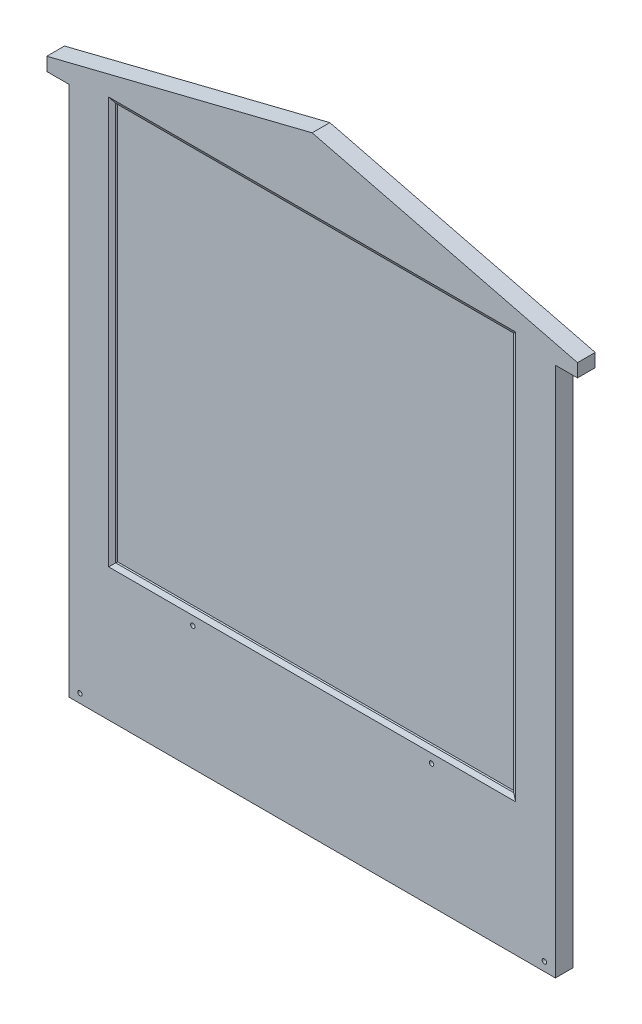
ISO-10303-21;
HEADER;
FILE_DESCRIPTION(('STEP AP214'),'2;1');
FILE_NAME('part.step','',(''),(''),'','','');
FILE_SCHEMA(('AUTOMOTIVE_DESIGN { 1 0 10303 214 1 1 1 1 }'));
ENDSEC;
DATA;
#1=APPLICATION_CONTEXT('core data for automotive mechanical design processes');
#2=APPLICATION_PROTOCOL_DEFINITION('international standard','automotive_design',2000,#1);
#3=PRODUCT_CONTEXT('',#1,'mechanical');
#4=PRODUCT('Part','Part','',(#3));
#5=PRODUCT_RELATED_PRODUCT_CATEGORY('part','',(#4));
#6=PRODUCT_DEFINITION_FORMATION('','',#4);
#7=PRODUCT_DEFINITION_CONTEXT('part definition',#1,'design');
#8=PRODUCT_DEFINITION('design','',#6,#7);
#9=PRODUCT_DEFINITION_SHAPE('','',#8);
#10=(LENGTH_UNIT() NAMED_UNIT(*) SI_UNIT(.MILLI.,.METRE.));
#11=(NAMED_UNIT(*) PLANE_ANGLE_UNIT() SI_UNIT($,.RADIAN.));
#12=(NAMED_UNIT(*) SI_UNIT($,.STERADIAN.) SOLID_ANGLE_UNIT());
#13=UNCERTAINTY_MEASURE_WITH_UNIT(LENGTH_MEASURE(1.E-05),#10,'distance_accuracy_value','');
#14=(GEOMETRIC_REPRESENTATION_CONTEXT(3) GLOBAL_UNCERTAINTY_ASSIGNED_CONTEXT((#13)) GLOBAL_UNIT_ASSIGNED_CONTEXT((#10,
#11,#12)) REPRESENTATION_CONTEXT('',''));
#15=CARTESIAN_POINT('',(0.,0.,0.));
#16=DIRECTION('',(0.,0.,1.));
#17=DIRECTION('',(1.,0.,0.));
#18=AXIS2_PLACEMENT_3D('',#15,#16,#17);
#19=CARTESIAN_POINT('',(-52.5,2.,2.00000000000002));
#20=DIRECTION('',(0.,0.,-1.));
#21=DIRECTION('',(-1.,0.,0.));
#22=AXIS2_PLACEMENT_3D('',#19,#20,#21);
#23=CYLINDRICAL_SURFACE('',#22,0.499999999999999);
#24=CARTESIAN_POINT('',(-52.5,2.,2.00000000000002));
#25=DIRECTION('',(0.,0.,-1.));
#26=DIRECTION('',(1.,0.,0.));
#27=AXIS2_PLACEMENT_3D('',#24,#25,#26);
#28=CIRCLE('',#27,0.499999999999999);
#29=CARTESIAN_POINT('',(-52.,2.,2.00000000000002));
#30=VERTEX_POINT('',#29);
#31=EDGE_CURVE('E180',#30,#30,#28,.T.);
#32=ORIENTED_EDGE('',*,*,#31,.F.);
#33=EDGE_LOOP('',(#32));
#34=FACE_BOUND('',#33,.T.);
#35=CARTESIAN_POINT('',(-52.5,2.,-0.999999999999988));
#36=DIRECTION('',(0.,0.,-1.));
#37=DIRECTION('',(-1.,0.,0.));
#38=AXIS2_PLACEMENT_3D('',#35,#36,#37);
#39=CIRCLE('',#38,0.499999999999999);
#40=CARTESIAN_POINT('',(-53.,2.,-0.999999999999988));
#41=VERTEX_POINT('',#40);
#42=EDGE_CURVE('E301',#41,#41,#39,.F.);
#43=ORIENTED_EDGE('',*,*,#42,.F.);
#44=EDGE_LOOP('',(#43));
#45=FACE_BOUND('',#44,.T.);
#46=ADVANCED_FACE('F38',(#34,#45),#23,.F.);
#47=CARTESIAN_POINT('',(-27.,28.,2.00000000000002));
#48=DIRECTION('',(0.,0.,-1.));
#49=DIRECTION('',(-1.,0.,0.));
#50=AXIS2_PLACEMENT_3D('',#47,#48,#49);
#51=CYLINDRICAL_SURFACE('',#50,0.499999999999999);
#52=CARTESIAN_POINT('',(-27.,28.,2.00000000000002));
#53=DIRECTION('',(0.,0.,-1.));
#54=DIRECTION('',(1.,0.,0.));
#55=AXIS2_PLACEMENT_3D('',#52,#53,#54);
#56=CIRCLE('',#55,0.499999999999999);
#57=CARTESIAN_POINT('',(-26.5,28.,2.00000000000002));
#58=VERTEX_POINT('',#57);
#59=EDGE_CURVE('E355',#58,#58,#56,.T.);
#60=ORIENTED_EDGE('',*,*,#59,.F.);
#61=EDGE_LOOP('',(#60));
#62=FACE_BOUND('',#61,.T.);
#63=CARTESIAN_POINT('',(-27.,28.,-0.999999999999991));
#64=DIRECTION('',(0.,0.,-1.));
#65=DIRECTION('',(-1.,0.,0.));
#66=AXIS2_PLACEMENT_3D('',#63,#64,#65);
#67=CIRCLE('',#66,0.499999999999999);
#68=CARTESIAN_POINT('',(-27.5,28.,-0.999999999999991));
#69=VERTEX_POINT('',#68);
#70=EDGE_CURVE('E297',#69,#69,#67,.F.);
#71=ORIENTED_EDGE('',*,*,#70,.F.);
#72=EDGE_LOOP('',(#71));
#73=FACE_BOUND('',#72,.T.);
#74=ADVANCED_FACE('F369',(#62,#73),#51,.F.);
#75=CARTESIAN_POINT('',(27.,28.,2.00000000000001));
#76=DIRECTION('',(0.,0.,-1.));
#77=DIRECTION('',(-1.,0.,0.));
#78=AXIS2_PLACEMENT_3D('',#75,#76,#77);
#79=CYLINDRICAL_SURFACE('',#78,0.499999999999999);
#80=CARTESIAN_POINT('',(27.,28.,2.00000000000001));
#81=DIRECTION('',(0.,0.,-1.));
#82=DIRECTION('',(-1.,0.,0.));
#83=AXIS2_PLACEMENT_3D('',#80,#81,#82);
#84=CIRCLE('',#83,0.499999999999999);
#85=CARTESIAN_POINT('',(26.5,28.,2.00000000000001));
#86=VERTEX_POINT('',#85);
#87=EDGE_CURVE('E177',#86,#86,#84,.T.);
#88=ORIENTED_EDGE('',*,*,#87,.F.);
#89=EDGE_LOOP('',(#88));
#90=FACE_BOUND('',#89,.T.);
#91=CARTESIAN_POINT('',(27.,28.,-0.999999999999998));
#92=DIRECTION('',(0.,0.,-1.));
#93=DIRECTION('',(-1.,0.,0.));
#94=AXIS2_PLACEMENT_3D('',#91,#92,#93);
#95=CIRCLE('',#94,0.499999999999999);
#96=CARTESIAN_POINT('',(26.5,28.,-0.999999999999998));
#97=VERTEX_POINT('',#96);
#98=EDGE_CURVE('E292',#97,#97,#95,.F.);
#99=ORIENTED_EDGE('',*,*,#98,.F.);
#100=EDGE_LOOP('',(#99));
#101=FACE_BOUND('',#100,.T.);
#102=ADVANCED_FACE('F393',(#90,#101),#79,.F.);
#103=CARTESIAN_POINT('',(52.5,2.,2.00000000000001));
#104=DIRECTION('',(0.,0.,-1.));
#105=DIRECTION('',(-1.,0.,0.));
#106=AXIS2_PLACEMENT_3D('',#103,#104,#105);
#107=CYLINDRICAL_SURFACE('',#106,0.499999999999999);
#108=CARTESIAN_POINT('',(52.5,2.,2.00000000000001));
#109=DIRECTION('',(0.,0.,-1.));
#110=DIRECTION('',(-1.,0.,0.));
#111=AXIS2_PLACEMENT_3D('',#108,#109,#110);
#112=CIRCLE('',#111,0.499999999999999);
#113=CARTESIAN_POINT('',(52.,2.,2.00000000000001));
#114=VERTEX_POINT('',#113);
#115=EDGE_CURVE('E173',#114,#114,#112,.T.);
#116=ORIENTED_EDGE('',*,*,#115,.F.);
#117=EDGE_LOOP('',(#116));
#118=FACE_BOUND('',#117,.T.);
#119=CARTESIAN_POINT('',(52.5,2.,-1.));
#120=DIRECTION('',(0.,0.,-1.));
#121=DIRECTION('',(-1.,0.,0.));
#122=AXIS2_PLACEMENT_3D('',#119,#120,#121);
#123=CIRCLE('',#122,0.499999999999999);
#124=CARTESIAN_POINT('',(52.,2.,-1.));
#125=VERTEX_POINT('',#124);
#126=EDGE_CURVE('E288',#125,#125,#123,.F.);
#127=ORIENTED_EDGE('',*,*,#126,.F.);
#128=EDGE_LOOP('',(#127));
#129=FACE_BOUND('',#128,.T.);
#130=ADVANCED_FACE('F390',(#118,#129),#107,.F.);
#131=CARTESIAN_POINT('',(55.0000000000002,120.,1.99999999999999));
#132=DIRECTION('',(0.,0.,-1.));
#133=DIRECTION('',(-1.,0.,0.));
#134=AXIS2_PLACEMENT_3D('',#131,#132,#133);
#135=PLANE('',#134);
#136=DIRECTION('',(0.,-1.,0.));
#137=VECTOR('',#136,1.);
#138=CARTESIAN_POINT('',(46.,120.,2.));
#139=LINE('',#138,#137);
#140=CARTESIAN_POINT('',(46.,122.,2.));
#141=VERTEX_POINT('',#140);
#142=CARTESIAN_POINT('',(46.,30.,2.));
#143=VERTEX_POINT('',#142);
#144=EDGE_CURVE('E313',#141,#143,#139,.T.);
#145=ORIENTED_EDGE('',*,*,#144,.T.);
#146=DIRECTION('',(-1.,0.,0.));
#147=VECTOR('',#146,1.);
#148=CARTESIAN_POINT('',(55.0000000000002,30.,1.99999999999999));
#149=LINE('',#148,#147);
#150=CARTESIAN_POINT('',(-46.,30.,2.00000000000001));
#151=VERTEX_POINT('',#150);
#152=EDGE_CURVE('E316',#143,#151,#149,.T.);
#153=ORIENTED_EDGE('',*,*,#152,.T.);
#154=DIRECTION('',(0.,1.,0.));
#155=VECTOR('',#154,1.);
#156=CARTESIAN_POINT('',(-46.,120.,2.00000000000001));
#157=LINE('',#156,#155);
#158=CARTESIAN_POINT('',(-46.,122.,2.00000000000001));
#159=VERTEX_POINT('',#158);
#160=EDGE_CURVE('E310',#151,#159,#157,.T.);
#161=ORIENTED_EDGE('',*,*,#160,.T.);
#162=DIRECTION('',(1.,0.,0.));
#163=VECTOR('',#162,1.);
#164=CARTESIAN_POINT('',(55.0000000000002,122.,1.99999999999999));
#165=LINE('',#164,#163);
#166=EDGE_CURVE('E307',#159,#141,#165,.T.);
#167=ORIENTED_EDGE('',*,*,#166,.T.);
#168=EDGE_LOOP('',(#145,#153,#161,#167));
#169=FACE_BOUND('',#168,.T.);
#170=ORIENTED_EDGE('',*,*,#115,.T.);
#171=EDGE_LOOP('',(#170));
#172=FACE_BOUND('',#171,.T.);
#173=ORIENTED_EDGE('',*,*,#87,.T.);
#174=EDGE_LOOP('',(#173));
#175=FACE_BOUND('',#174,.T.);
#176=ORIENTED_EDGE('',*,*,#59,.T.);
#177=EDGE_LOOP('',(#176));
#178=FACE_BOUND('',#177,.T.);
#179=ORIENTED_EDGE('',*,*,#31,.T.);
#180=EDGE_LOOP('',(#179));
#181=FACE_BOUND('',#180,.T.);
#182=DIRECTION('',(-0.970142500145332,0.242535625036333,0.));
#183=VECTOR('',#182,1.);
#184=CARTESIAN_POINT('',(0.,138.,2.));
#185=LINE('',#184,#183);
#186=CARTESIAN_POINT('',(60.,123.,2.));
#187=VERTEX_POINT('',#186);
#188=CARTESIAN_POINT('',(0.,138.,2.));
#189=VERTEX_POINT('',#188);
#190=EDGE_CURVE('E190',#187,#189,#185,.T.);
#191=ORIENTED_EDGE('',*,*,#190,.T.);
#192=DIRECTION('',(0.970142500145332,0.242535625036333,0.));
#193=VECTOR('',#192,1.);
#194=CARTESIAN_POINT('',(0.,138.,2.));
#195=LINE('',#194,#193);
#196=CARTESIAN_POINT('',(-60.,123.,2.));
#197=VERTEX_POINT('',#196);
#198=EDGE_CURVE('E206',#197,#189,#195,.T.);
#199=ORIENTED_EDGE('',*,*,#198,.F.);
#200=DIRECTION('',(0.,-1.,0.));
#201=VECTOR('',#200,1.);
#202=CARTESIAN_POINT('',(-60.,138.,2.));
#203=LINE('',#202,#201);
#204=CARTESIAN_POINT('',(-60.,120.,2.));
#205=VERTEX_POINT('',#204);
#206=EDGE_CURVE('E247',#197,#205,#203,.T.);
#207=ORIENTED_EDGE('',*,*,#206,.T.);
#208=DIRECTION('',(1.,0.,0.));
#209=VECTOR('',#208,1.);
#210=CARTESIAN_POINT('',(60.,120.,2.));
#211=LINE('',#210,#209);
#212=CARTESIAN_POINT('',(-54.9999999999998,120.,2.00000000000001));
#213=VERTEX_POINT('',#212);
#214=EDGE_CURVE('E225',#205,#213,#211,.T.);
#215=ORIENTED_EDGE('',*,*,#214,.T.);
#216=DIRECTION('',(0.,-1.,0.));
#217=VECTOR('',#216,1.);
#218=CARTESIAN_POINT('',(-54.9999999999998,120.,2.00000000000001));
#219=LINE('',#218,#217);
#220=CARTESIAN_POINT('',(-54.9999999999998,0.,2.00000000000001));
#221=VERTEX_POINT('',#220);
#222=EDGE_CURVE('E283',#213,#221,#219,.T.);
#223=ORIENTED_EDGE('',*,*,#222,.T.);
#224=DIRECTION('',(1.,0.,0.));
#225=VECTOR('',#224,1.);
#226=CARTESIAN_POINT('',(55.0000000000002,0.,1.99999999999999));
#227=LINE('',#226,#225);
#228=CARTESIAN_POINT('',(55.0000000000002,0.,1.99999999999999));
#229=VERTEX_POINT('',#228);
#230=EDGE_CURVE('E264',#221,#229,#227,.T.);
#231=ORIENTED_EDGE('',*,*,#230,.T.);
#232=DIRECTION('',(0.,-1.,0.));
#233=VECTOR('',#232,1.);
#234=CARTESIAN_POINT('',(55.0000000000002,120.,1.99999999999999));
#235=LINE('',#234,#233);
#236=CARTESIAN_POINT('',(55.0000000000002,120.,1.99999999999999));
#237=VERTEX_POINT('',#236);
#238=EDGE_CURVE('E279',#237,#229,#235,.T.);
#239=ORIENTED_EDGE('',*,*,#238,.F.);
#240=CARTESIAN_POINT('',(60.,120.,2.));
#241=VERTEX_POINT('',#240);
#242=EDGE_CURVE('E224',#237,#241,#211,.T.);
#243=ORIENTED_EDGE('',*,*,#242,.T.);
#244=DIRECTION('',(0.,-1.,0.));
#245=VECTOR('',#244,1.);
#246=CARTESIAN_POINT('',(60.,138.,2.));
#247=LINE('',#246,#245);
#248=EDGE_CURVE('E244',#187,#241,#247,.T.);
#249=ORIENTED_EDGE('',*,*,#248,.F.);
#250=EDGE_LOOP('',(#191,#199,#207,#215,#223,#231,#239,#243,#249));
#251=FACE_BOUND('',#250,.T.);
#252=ADVANCED_FACE('F364',(#169,#172,#175,#178,#181,#251),#135,.F.);
#253=CARTESIAN_POINT('',(55.0000000000002,120.,-2.));
#254=DIRECTION('',(0.,0.,1.));
#255=DIRECTION('',(1.,0.,0.));
#256=AXIS2_PLACEMENT_3D('',#253,#254,#255);
#257=PLANE('',#256);
#258=CARTESIAN_POINT('',(52.5,2.,-2.));
#259=DIRECTION('',(0.,0.,-1.));
#260=DIRECTION('',(-1.,0.,0.));
#261=AXIS2_PLACEMENT_3D('',#258,#259,#260);
#262=CIRCLE('',#261,1.25);
#263=CARTESIAN_POINT('',(51.25,2.,-2.));
#264=VERTEX_POINT('',#263);
#265=EDGE_CURVE('E517',#264,#264,#262,.T.);
#266=ORIENTED_EDGE('',*,*,#265,.F.);
#267=EDGE_LOOP('',(#266));
#268=FACE_BOUND('',#267,.T.);
#269=CARTESIAN_POINT('',(27.,28.,-2.));
#270=DIRECTION('',(0.,0.,-1.));
#271=DIRECTION('',(-1.,0.,0.));
#272=AXIS2_PLACEMENT_3D('',#269,#270,#271);
#273=CIRCLE('',#272,1.25);
#274=CARTESIAN_POINT('',(25.75,28.,-2.));
#275=VERTEX_POINT('',#274);
#276=EDGE_CURVE('E506',#275,#275,#273,.T.);
#277=ORIENTED_EDGE('',*,*,#276,.F.);
#278=EDGE_LOOP('',(#277));
#279=FACE_BOUND('',#278,.T.);
#280=CARTESIAN_POINT('',(-27.,28.,-1.99999999999999));
#281=DIRECTION('',(0.,0.,-1.));
#282=DIRECTION('',(-1.,0.,0.));
#283=AXIS2_PLACEMENT_3D('',#280,#281,#282);
#284=CIRCLE('',#283,1.25);
#285=CARTESIAN_POINT('',(-28.25,28.,-1.99999999999999));
#286=VERTEX_POINT('',#285);
#287=EDGE_CURVE('E349',#286,#286,#284,.T.);
#288=ORIENTED_EDGE('',*,*,#287,.F.);
#289=EDGE_LOOP('',(#288));
#290=FACE_BOUND('',#289,.T.);
#291=CARTESIAN_POINT('',(-52.5,2.,-1.99999999999999));
#292=DIRECTION('',(0.,0.,-1.));
#293=DIRECTION('',(-1.,0.,0.));
#294=AXIS2_PLACEMENT_3D('',#291,#292,#293);
#295=CIRCLE('',#294,1.25000000000001);
#296=CARTESIAN_POINT('',(-53.75,2.,-1.99999999999999));
#297=VERTEX_POINT('',#296);
#298=EDGE_CURVE('E337',#297,#297,#295,.T.);
#299=ORIENTED_EDGE('',*,*,#298,.F.);
#300=EDGE_LOOP('',(#299));
#301=FACE_BOUND('',#300,.T.);
#302=DIRECTION('',(-0.970142500145332,0.242535625036333,0.));
#303=VECTOR('',#302,1.);
#304=CARTESIAN_POINT('',(0.,138.,-2.));
#305=LINE('',#304,#303);
#306=CARTESIAN_POINT('',(60.,123.,-2.));
#307=VERTEX_POINT('',#306);
#308=CARTESIAN_POINT('',(0.,138.,-2.));
#309=VERTEX_POINT('',#308);
#310=EDGE_CURVE('E196',#307,#309,#305,.T.);
#311=ORIENTED_EDGE('',*,*,#310,.F.);
#312=DIRECTION('',(0.,-1.,0.));
#313=VECTOR('',#312,1.);
#314=CARTESIAN_POINT('',(60.,138.,-2.));
#315=LINE('',#314,#313);
#316=CARTESIAN_POINT('',(60.,120.,-2.));
#317=VERTEX_POINT('',#316);
#318=EDGE_CURVE('E241',#307,#317,#315,.T.);
#319=ORIENTED_EDGE('',*,*,#318,.T.);
#320=DIRECTION('',(-1.,0.,0.));
#321=VECTOR('',#320,1.);
#322=CARTESIAN_POINT('',(60.,120.,-2.));
#323=LINE('',#322,#321);
#324=CARTESIAN_POINT('',(55.0000000000002,120.,-2.));
#325=VERTEX_POINT('',#324);
#326=EDGE_CURVE('E234',#317,#325,#323,.T.);
#327=ORIENTED_EDGE('',*,*,#326,.T.);
#328=DIRECTION('',(0.,-1.,0.));
#329=VECTOR('',#328,1.);
#330=CARTESIAN_POINT('',(55.0000000000002,120.,-2.));
#331=LINE('',#330,#329);
#332=CARTESIAN_POINT('',(55.0000000000002,0.,-2.));
#333=VERTEX_POINT('',#332);
#334=EDGE_CURVE('E275',#325,#333,#331,.T.);
#335=ORIENTED_EDGE('',*,*,#334,.T.);
#336=DIRECTION('',(-1.,0.,0.));
#337=VECTOR('',#336,1.);
#338=CARTESIAN_POINT('',(55.0000000000002,0.,-2.));
#339=LINE('',#338,#337);
#340=CARTESIAN_POINT('',(-54.9999999999998,0.,-1.99999999999999));
#341=VERTEX_POINT('',#340);
#342=EDGE_CURVE('E256',#333,#341,#339,.T.);
#343=ORIENTED_EDGE('',*,*,#342,.T.);
#344=DIRECTION('',(0.,-1.,0.));
#345=VECTOR('',#344,1.);
#346=CARTESIAN_POINT('',(-54.9999999999998,120.,-1.99999999999999));
#347=LINE('',#346,#345);
#348=CARTESIAN_POINT('',(-54.9999999999998,120.,-1.99999999999999));
#349=VERTEX_POINT('',#348);
#350=EDGE_CURVE('E260',#349,#341,#347,.T.);
#351=ORIENTED_EDGE('',*,*,#350,.F.);
#352=CARTESIAN_POINT('',(-60.,120.,-2.));
#353=VERTEX_POINT('',#352);
#354=EDGE_CURVE('E233',#349,#353,#323,.T.);
#355=ORIENTED_EDGE('',*,*,#354,.T.);
#356=DIRECTION('',(0.,-1.,0.));
#357=VECTOR('',#356,1.);
#358=CARTESIAN_POINT('',(-60.,138.,-2.));
#359=LINE('',#358,#357);
#360=CARTESIAN_POINT('',(-60.,123.,-2.));
#361=VERTEX_POINT('',#360);
#362=EDGE_CURVE('E238',#361,#353,#359,.T.);
#363=ORIENTED_EDGE('',*,*,#362,.F.);
#364=DIRECTION('',(0.970142500145332,0.242535625036333,0.));
#365=VECTOR('',#364,1.);
#366=CARTESIAN_POINT('',(0.,138.,-2.));
#367=LINE('',#366,#365);
#368=EDGE_CURVE('E207',#361,#309,#367,.T.);
#369=ORIENTED_EDGE('',*,*,#368,.T.);
#370=EDGE_LOOP('',(#311,#319,#327,#335,#343,#351,#355,#363,#369));
#371=FACE_BOUND('',#370,.T.);
#372=ADVANCED_FACE('F433',(#268,#279,#290,#301,#371),#257,.F.);
#373=CARTESIAN_POINT('',(60.,138.,2.));
#374=DIRECTION('',(-1.,0.,0.));
#375=DIRECTION('',(0.,0.,1.));
#376=AXIS2_PLACEMENT_3D('',#373,#374,#375);
#377=PLANE('',#376);
#378=DIRECTION('',(0.,0.,1.));
#379=VECTOR('',#378,1.);
#380=CARTESIAN_POINT('',(60.,123.,-2.));
#381=LINE('',#380,#379);
#382=EDGE_CURVE('E199',#307,#187,#381,.T.);
#383=ORIENTED_EDGE('',*,*,#382,.T.);
#384=ORIENTED_EDGE('',*,*,#248,.T.);
#385=DIRECTION('',(0.,0.,-1.));
#386=VECTOR('',#385,1.);
#387=CARTESIAN_POINT('',(60.,120.,2.));
#388=LINE('',#387,#386);
#389=EDGE_CURVE('E229',#241,#317,#388,.T.);
#390=ORIENTED_EDGE('',*,*,#389,.T.);
#391=ORIENTED_EDGE('',*,*,#318,.F.);
#392=EDGE_LOOP('',(#383,#384,#390,#391));
#393=FACE_BOUND('',#392,.T.);
#394=ADVANCED_FACE('F429',(#393),#377,.F.);
#395=CARTESIAN_POINT('',(-54.9999999999998,120.,2.00000000000001));
#396=DIRECTION('',(1.,0.,0.));
#397=DIRECTION('',(0.,0.,-1.));
#398=AXIS2_PLACEMENT_3D('',#395,#396,#397);
#399=PLANE('',#398);
#400=DIRECTION('',(0.,0.,1.));
#401=VECTOR('',#400,1.);
#402=CARTESIAN_POINT('',(-54.9999999999998,0.,2.00000000000001));
#403=LINE('',#402,#401);
#404=EDGE_CURVE('E250',#341,#221,#403,.T.);
#405=ORIENTED_EDGE('',*,*,#404,.T.);
#406=ORIENTED_EDGE('',*,*,#222,.F.);
#407=DIRECTION('',(0.,0.,1.));
#408=VECTOR('',#407,1.);
#409=CARTESIAN_POINT('',(-54.9999999999998,120.,2.00000000000001));
#410=LINE('',#409,#408);
#411=EDGE_CURVE('E251',#349,#213,#410,.T.);
#412=ORIENTED_EDGE('',*,*,#411,.F.);
#413=ORIENTED_EDGE('',*,*,#350,.T.);
#414=EDGE_LOOP('',(#405,#406,#412,#413));
#415=FACE_BOUND('',#414,.T.);
#416=ADVANCED_FACE('F432',(#415),#399,.F.);
#417=CARTESIAN_POINT('',(55.0000000000002,120.,1.99999999999999));
#418=DIRECTION('',(-1.,0.,0.));
#419=DIRECTION('',(0.,0.,1.));
#420=AXIS2_PLACEMENT_3D('',#417,#418,#419);
#421=PLANE('',#420);
#422=DIRECTION('',(0.,0.,-1.));
#423=VECTOR('',#422,1.);
#424=CARTESIAN_POINT('',(55.0000000000002,0.,1.99999999999999));
#425=LINE('',#424,#423);
#426=EDGE_CURVE('E267',#229,#333,#425,.T.);
#427=ORIENTED_EDGE('',*,*,#426,.T.);
#428=ORIENTED_EDGE('',*,*,#334,.F.);
#429=DIRECTION('',(0.,0.,-1.));
#430=VECTOR('',#429,1.);
#431=CARTESIAN_POINT('',(55.0000000000002,120.,1.99999999999999));
#432=LINE('',#431,#430);
#433=EDGE_CURVE('E255',#237,#325,#432,.T.);
#434=ORIENTED_EDGE('',*,*,#433,.F.);
#435=ORIENTED_EDGE('',*,*,#238,.T.);
#436=EDGE_LOOP('',(#427,#428,#434,#435));
#437=FACE_BOUND('',#436,.T.);
#438=ADVANCED_FACE('F440',(#437),#421,.F.);
#439=CARTESIAN_POINT('',(0.,0.,0.));
#440=DIRECTION('',(0.,1.,0.));
#441=DIRECTION('',(0.,0.,1.));
#442=AXIS2_PLACEMENT_3D('',#439,#440,#441);
#443=PLANE('',#442);
#444=ORIENTED_EDGE('',*,*,#404,.F.);
#445=ORIENTED_EDGE('',*,*,#342,.F.);
#446=ORIENTED_EDGE('',*,*,#426,.F.);
#447=ORIENTED_EDGE('',*,*,#230,.F.);
#448=EDGE_LOOP('',(#444,#445,#446,#447));
#449=FACE_BOUND('',#448,.T.);
#450=ADVANCED_FACE('F427',(#449),#443,.F.);
#451=CARTESIAN_POINT('',(0.,120.,0.));
#452=DIRECTION('',(0.,1.,0.));
#453=DIRECTION('',(0.,0.,1.));
#454=AXIS2_PLACEMENT_3D('',#451,#452,#453);
#455=PLANE('',#454);
#456=ORIENTED_EDGE('',*,*,#354,.F.);
#457=ORIENTED_EDGE('',*,*,#411,.T.);
#458=ORIENTED_EDGE('',*,*,#214,.F.);
#459=DIRECTION('',(0.,0.,1.));
#460=VECTOR('',#459,1.);
#461=CARTESIAN_POINT('',(-60.,120.,2.));
#462=LINE('',#461,#460);
#463=EDGE_CURVE('E218',#353,#205,#462,.T.);
#464=ORIENTED_EDGE('',*,*,#463,.F.);
#465=EDGE_LOOP('',(#456,#457,#458,#464));
#466=FACE_BOUND('',#465,.T.);
#467=ADVANCED_FACE('F423',(#466),#455,.F.);
#468=ORIENTED_EDGE('',*,*,#242,.F.);
#469=ORIENTED_EDGE('',*,*,#433,.T.);
#470=ORIENTED_EDGE('',*,*,#326,.F.);
#471=ORIENTED_EDGE('',*,*,#389,.F.);
#472=EDGE_LOOP('',(#468,#469,#470,#471));
#473=FACE_BOUND('',#472,.T.);
#474=ADVANCED_FACE('F426',(#473),#455,.F.);
#475=CARTESIAN_POINT('',(-60.,138.,2.));
#476=DIRECTION('',(1.,0.,0.));
#477=DIRECTION('',(0.,0.,-1.));
#478=AXIS2_PLACEMENT_3D('',#475,#476,#477);
#479=PLANE('',#478);
#480=ORIENTED_EDGE('',*,*,#206,.F.);
#481=DIRECTION('',(0.,0.,1.));
#482=VECTOR('',#481,1.);
#483=CARTESIAN_POINT('',(-60.,123.,-2.));
#484=LINE('',#483,#482);
#485=EDGE_CURVE('E211',#361,#197,#484,.T.);
#486=ORIENTED_EDGE('',*,*,#485,.F.);
#487=ORIENTED_EDGE('',*,*,#362,.T.);
#488=ORIENTED_EDGE('',*,*,#463,.T.);
#489=EDGE_LOOP('',(#480,#486,#487,#488));
#490=FACE_BOUND('',#489,.T.);
#491=ADVANCED_FACE('F421',(#490),#479,.F.);
#492=CARTESIAN_POINT('',(0.,138.,-2.));
#493=DIRECTION('',(0.242535625036333,-0.970142500145332,0.));
#494=DIRECTION('',(0.970142500145332,0.242535625036333,0.));
#495=AXIS2_PLACEMENT_3D('',#492,#493,#494);
#496=PLANE('',#495);
#497=ORIENTED_EDGE('',*,*,#198,.T.);
#498=DIRECTION('',(0.,0.,1.));
#499=VECTOR('',#498,1.);
#500=CARTESIAN_POINT('',(0.,138.,-2.));
#501=LINE('',#500,#499);
#502=EDGE_CURVE('E215',#309,#189,#501,.T.);
#503=ORIENTED_EDGE('',*,*,#502,.F.);
#504=ORIENTED_EDGE('',*,*,#368,.F.);
#505=ORIENTED_EDGE('',*,*,#485,.T.);
#506=EDGE_LOOP('',(#497,#503,#504,#505));
#507=FACE_BOUND('',#506,.T.);
#508=ADVANCED_FACE('F417',(#507),#496,.F.);
#509=CARTESIAN_POINT('',(0.,138.,-2.));
#510=DIRECTION('',(0.242535625036333,0.970142500145332,0.));
#511=DIRECTION('',(-0.970142500145332,0.242535625036333,0.));
#512=AXIS2_PLACEMENT_3D('',#509,#510,#511);
#513=PLANE('',#512);
#514=ORIENTED_EDGE('',*,*,#190,.F.);
#515=ORIENTED_EDGE('',*,*,#382,.F.);
#516=ORIENTED_EDGE('',*,*,#310,.T.);
#517=ORIENTED_EDGE('',*,*,#502,.T.);
#518=EDGE_LOOP('',(#514,#515,#516,#517));
#519=FACE_BOUND('',#518,.T.);
#520=ADVANCED_FACE('F414',(#519),#513,.T.);
#521=CARTESIAN_POINT('',(-45.,31.,1.));
#522=DIRECTION('',(-1.,0.,0.));
#523=DIRECTION('',(0.,0.,1.));
#524=AXIS2_PLACEMENT_3D('',#521,#522,#523);
#525=PLANE('',#524);
#526=DIRECTION('',(0.,0.,1.));
#527=VECTOR('',#526,1.);
#528=CARTESIAN_POINT('',(-45.,121.,1.));
#529=LINE('',#528,#527);
#530=CARTESIAN_POINT('',(-45.,121.,1.));
#531=VERTEX_POINT('',#530);
#532=CARTESIAN_POINT('',(-45.,121.,1.4226497308104));
#533=VERTEX_POINT('',#532);
#534=EDGE_CURVE('E187',#531,#533,#529,.T.);
#535=ORIENTED_EDGE('',*,*,#534,.T.);
#536=DIRECTION('',(0.,-1.,0.));
#537=VECTOR('',#536,1.);
#538=CARTESIAN_POINT('',(-45.,31.,1.4226497308104));
#539=LINE('',#538,#537);
#540=CARTESIAN_POINT('',(-45.,31.,1.4226497308104));
#541=VERTEX_POINT('',#540);
#542=EDGE_CURVE('E48',#533,#541,#539,.T.);
#543=ORIENTED_EDGE('',*,*,#542,.T.);
#544=DIRECTION('',(0.,0.,1.));
#545=VECTOR('',#544,1.);
#546=CARTESIAN_POINT('',(-45.,31.,1.));
#547=LINE('',#546,#545);
#548=CARTESIAN_POINT('',(-45.,31.,1.));
#549=VERTEX_POINT('',#548);
#550=EDGE_CURVE('E147',#549,#541,#547,.T.);
#551=ORIENTED_EDGE('',*,*,#550,.F.);
#552=DIRECTION('',(0.,-1.,0.));
#553=VECTOR('',#552,1.);
#554=CARTESIAN_POINT('',(-45.,31.,1.));
#555=LINE('',#554,#553);
#556=EDGE_CURVE('E151',#531,#549,#555,.T.);
#557=ORIENTED_EDGE('',*,*,#556,.F.);
#558=EDGE_LOOP('',(#535,#543,#551,#557));
#559=FACE_BOUND('',#558,.T.);
#560=ADVANCED_FACE('F149',(#559),#525,.F.);
#561=CARTESIAN_POINT('',(45.,121.,1.));
#562=DIRECTION('',(0.,1.,0.));
#563=DIRECTION('',(-1.,0.,0.));
#564=AXIS2_PLACEMENT_3D('',#561,#562,#563);
#565=PLANE('',#564);
#566=DIRECTION('',(0.,0.,1.));
#567=VECTOR('',#566,1.);
#568=CARTESIAN_POINT('',(45.,121.,1.));
#569=LINE('',#568,#567);
#570=CARTESIAN_POINT('',(45.,121.,1.));
#571=VERTEX_POINT('',#570);
#572=CARTESIAN_POINT('',(45.,121.,1.4226497308104));
#573=VERTEX_POINT('',#572);
#574=EDGE_CURVE('E191',#571,#573,#569,.T.);
#575=ORIENTED_EDGE('',*,*,#574,.T.);
#576=DIRECTION('',(-1.,0.,0.));
#577=VECTOR('',#576,1.);
#578=CARTESIAN_POINT('',(45.,121.,1.42264973081039));
#579=LINE('',#578,#577);
#580=EDGE_CURVE('E11',#573,#533,#579,.T.);
#581=ORIENTED_EDGE('',*,*,#580,.T.);
#582=ORIENTED_EDGE('',*,*,#534,.F.);
#583=DIRECTION('',(-1.,0.,0.));
#584=VECTOR('',#583,1.);
#585=CARTESIAN_POINT('',(45.,121.,1.));
#586=LINE('',#585,#584);
#587=EDGE_CURVE('E159',#571,#531,#586,.T.);
#588=ORIENTED_EDGE('',*,*,#587,.F.);
#589=EDGE_LOOP('',(#575,#581,#582,#588));
#590=FACE_BOUND('',#589,.T.);
#591=ADVANCED_FACE('F404',(#590),#565,.F.);
#592=CARTESIAN_POINT('',(45.,31.,1.));
#593=DIRECTION('',(1.,0.,0.));
#594=DIRECTION('',(0.,0.,-1.));
#595=AXIS2_PLACEMENT_3D('',#592,#593,#594);
#596=PLANE('',#595);
#597=DIRECTION('',(0.,0.,1.));
#598=VECTOR('',#597,1.);
#599=CARTESIAN_POINT('',(45.,31.,1.));
#600=LINE('',#599,#598);
#601=CARTESIAN_POINT('',(45.,31.,1.));
#602=VERTEX_POINT('',#601);
#603=CARTESIAN_POINT('',(45.,31.,1.42264973081039));
#604=VERTEX_POINT('',#603);
#605=EDGE_CURVE('E158',#602,#604,#600,.T.);
#606=ORIENTED_EDGE('',*,*,#605,.T.);
#607=DIRECTION('',(0.,1.,0.));
#608=VECTOR('',#607,1.);
#609=CARTESIAN_POINT('',(45.,31.,1.42264973081039));
#610=LINE('',#609,#608);
#611=EDGE_CURVE('E62',#604,#573,#610,.T.);
#612=ORIENTED_EDGE('',*,*,#611,.T.);
#613=ORIENTED_EDGE('',*,*,#574,.F.);
#614=DIRECTION('',(0.,1.,0.));
#615=VECTOR('',#614,1.);
#616=CARTESIAN_POINT('',(45.,31.,1.));
#617=LINE('',#616,#615);
#618=EDGE_CURVE('E168',#602,#571,#617,.T.);
#619=ORIENTED_EDGE('',*,*,#618,.F.);
#620=EDGE_LOOP('',(#606,#612,#613,#619));
#621=FACE_BOUND('',#620,.T.);
#622=ADVANCED_FACE('F407',(#621),#596,.F.);
#623=CARTESIAN_POINT('',(45.,31.,1.));
#624=DIRECTION('',(0.,-1.,0.));
#625=DIRECTION('',(1.,0.,0.));
#626=AXIS2_PLACEMENT_3D('',#623,#624,#625);
#627=PLANE('',#626);
#628=ORIENTED_EDGE('',*,*,#550,.T.);
#629=DIRECTION('',(1.,0.,0.));
#630=VECTOR('',#629,1.);
#631=CARTESIAN_POINT('',(45.,31.,1.42264973081039));
#632=LINE('',#631,#630);
#633=EDGE_CURVE('E287',#541,#604,#632,.T.);
#634=ORIENTED_EDGE('',*,*,#633,.T.);
#635=ORIENTED_EDGE('',*,*,#605,.F.);
#636=DIRECTION('',(1.,0.,0.));
#637=VECTOR('',#636,1.);
#638=CARTESIAN_POINT('',(45.,31.,1.));
#639=LINE('',#638,#637);
#640=EDGE_CURVE('E162',#549,#602,#639,.T.);
#641=ORIENTED_EDGE('',*,*,#640,.F.);
#642=EDGE_LOOP('',(#628,#634,#635,#641));
#643=FACE_BOUND('',#642,.T.);
#644=ADVANCED_FACE('F163',(#643),#627,.F.);
#645=CARTESIAN_POINT('',(0.,0.,1.));
#646=DIRECTION('',(0.,0.,1.));
#647=DIRECTION('',(1.,0.,0.));
#648=AXIS2_PLACEMENT_3D('',#645,#646,#647);
#649=PLANE('',#648);
#650=ORIENTED_EDGE('',*,*,#556,.T.);
#651=ORIENTED_EDGE('',*,*,#640,.T.);
#652=ORIENTED_EDGE('',*,*,#618,.T.);
#653=ORIENTED_EDGE('',*,*,#587,.T.);
#654=EDGE_LOOP('',(#650,#651,#652,#653));
#655=FACE_BOUND('',#654,.T.);
#656=ADVANCED_FACE('F170',(#655),#649,.T.);
#657=CARTESIAN_POINT('',(52.5,2.,-1.));
#658=DIRECTION('',(0.,0.,-1.));
#659=DIRECTION('',(-1.,0.,0.));
#660=AXIS2_PLACEMENT_3D('',#657,#658,#659);
#661=PLANE('',#660);
#662=CARTESIAN_POINT('',(52.5,2.,-1.));
#663=DIRECTION('',(0.,0.,-1.));
#664=DIRECTION('',(-1.,0.,0.));
#665=AXIS2_PLACEMENT_3D('',#662,#663,#664);
#666=CIRCLE('',#665,1.25);
#667=CARTESIAN_POINT('',(51.25,2.,-1.));
#668=VERTEX_POINT('',#667);
#669=EDGE_CURVE('E293',#668,#668,#666,.T.);
#670=ORIENTED_EDGE('',*,*,#669,.T.);
#671=EDGE_LOOP('',(#670));
#672=FACE_BOUND('',#671,.T.);
#673=ORIENTED_EDGE('',*,*,#126,.T.);
#674=EDGE_LOOP('',(#673));
#675=FACE_BOUND('',#674,.T.);
#676=ADVANCED_FACE('F403',(#672,#675),#661,.T.);
#677=CARTESIAN_POINT('',(52.5,2.,-1.));
#678=DIRECTION('',(0.,0.,-1.));
#679=DIRECTION('',(-1.,0.,0.));
#680=AXIS2_PLACEMENT_3D('',#677,#678,#679);
#681=CYLINDRICAL_SURFACE('',#680,1.25);
#682=ORIENTED_EDGE('',*,*,#669,.F.);
#683=EDGE_LOOP('',(#682));
#684=FACE_BOUND('',#683,.T.);
#685=ORIENTED_EDGE('',*,*,#265,.T.);
#686=EDGE_LOOP('',(#685));
#687=FACE_BOUND('',#686,.T.);
#688=ADVANCED_FACE('F482',(#684,#687),#681,.F.);
#689=CARTESIAN_POINT('',(27.,28.,-0.999999999999998));
#690=DIRECTION('',(0.,0.,-1.));
#691=DIRECTION('',(-1.,0.,0.));
#692=AXIS2_PLACEMENT_3D('',#689,#690,#691);
#693=PLANE('',#692);
#694=CARTESIAN_POINT('',(27.,28.,-0.999999999999998));
#695=DIRECTION('',(0.,0.,-1.));
#696=DIRECTION('',(-1.,0.,0.));
#697=AXIS2_PLACEMENT_3D('',#694,#695,#696);
#698=CIRCLE('',#697,1.25);
#699=CARTESIAN_POINT('',(25.75,28.,-0.999999999999998));
#700=VERTEX_POINT('',#699);
#701=EDGE_CURVE('E511',#700,#700,#698,.T.);
#702=ORIENTED_EDGE('',*,*,#701,.T.);
#703=EDGE_LOOP('',(#702));
#704=FACE_BOUND('',#703,.T.);
#705=ORIENTED_EDGE('',*,*,#98,.T.);
#706=EDGE_LOOP('',(#705));
#707=FACE_BOUND('',#706,.T.);
#708=ADVANCED_FACE('F479',(#704,#707),#693,.T.);
#709=CARTESIAN_POINT('',(27.,28.,-0.999999999999998));
#710=DIRECTION('',(0.,0.,-1.));
#711=DIRECTION('',(-1.,0.,0.));
#712=AXIS2_PLACEMENT_3D('',#709,#710,#711);
#713=CYLINDRICAL_SURFACE('',#712,1.25);
#714=ORIENTED_EDGE('',*,*,#701,.F.);
#715=EDGE_LOOP('',(#714));
#716=FACE_BOUND('',#715,.T.);
#717=ORIENTED_EDGE('',*,*,#276,.T.);
#718=EDGE_LOOP('',(#717));
#719=FACE_BOUND('',#718,.T.);
#720=ADVANCED_FACE('F481',(#716,#719),#713,.F.);
#721=CARTESIAN_POINT('',(-27.,28.,-0.999999999999991));
#722=DIRECTION('',(0.,0.,-1.));
#723=DIRECTION('',(-1.,0.,0.));
#724=AXIS2_PLACEMENT_3D('',#721,#722,#723);
#725=PLANE('',#724);
#726=CARTESIAN_POINT('',(-27.,28.,-0.999999999999991));
#727=DIRECTION('',(0.,0.,-1.));
#728=DIRECTION('',(-1.,0.,0.));
#729=AXIS2_PLACEMENT_3D('',#726,#727,#728);
#730=CIRCLE('',#729,1.25);
#731=CARTESIAN_POINT('',(-28.25,28.,-0.999999999999991));
#732=VERTEX_POINT('',#731);
#733=EDGE_CURVE('E502',#732,#732,#730,.T.);
#734=ORIENTED_EDGE('',*,*,#733,.T.);
#735=EDGE_LOOP('',(#734));
#736=FACE_BOUND('',#735,.T.);
#737=ORIENTED_EDGE('',*,*,#70,.T.);
#738=EDGE_LOOP('',(#737));
#739=FACE_BOUND('',#738,.T.);
#740=ADVANCED_FACE('F385',(#736,#739),#725,.T.);
#741=CARTESIAN_POINT('',(-27.,28.,-0.999999999999991));
#742=DIRECTION('',(0.,0.,-1.));
#743=DIRECTION('',(-1.,0.,0.));
#744=AXIS2_PLACEMENT_3D('',#741,#742,#743);
#745=CYLINDRICAL_SURFACE('',#744,1.25);
#746=ORIENTED_EDGE('',*,*,#733,.F.);
#747=EDGE_LOOP('',(#746));
#748=FACE_BOUND('',#747,.T.);
#749=ORIENTED_EDGE('',*,*,#287,.T.);
#750=EDGE_LOOP('',(#749));
#751=FACE_BOUND('',#750,.T.);
#752=ADVANCED_FACE('F376',(#748,#751),#745,.F.);
#753=CARTESIAN_POINT('',(-52.5,2.,-0.999999999999988));
#754=DIRECTION('',(0.,0.,-1.));
#755=DIRECTION('',(-1.,0.,0.));
#756=AXIS2_PLACEMENT_3D('',#753,#754,#755);
#757=PLANE('',#756);
#758=CARTESIAN_POINT('',(-52.5,2.,-0.999999999999988));
#759=DIRECTION('',(0.,0.,-1.));
#760=DIRECTION('',(-1.,0.,0.));
#761=AXIS2_PLACEMENT_3D('',#758,#759,#760);
#762=CIRCLE('',#761,1.25000000000001);
#763=CARTESIAN_POINT('',(-53.75,2.,-0.999999999999988));
#764=VERTEX_POINT('',#763);
#765=EDGE_CURVE('E343',#764,#764,#762,.T.);
#766=ORIENTED_EDGE('',*,*,#765,.T.);
#767=EDGE_LOOP('',(#766));
#768=FACE_BOUND('',#767,.T.);
#769=ORIENTED_EDGE('',*,*,#42,.T.);
#770=EDGE_LOOP('',(#769));
#771=FACE_BOUND('',#770,.T.);
#772=ADVANCED_FACE('F373',(#768,#771),#757,.T.);
#773=CARTESIAN_POINT('',(-52.5,2.,-0.999999999999988));
#774=DIRECTION('',(0.,0.,-1.));
#775=DIRECTION('',(-1.,0.,0.));
#776=AXIS2_PLACEMENT_3D('',#773,#774,#775);
#777=CYLINDRICAL_SURFACE('',#776,1.25000000000001);
#778=ORIENTED_EDGE('',*,*,#765,.F.);
#779=EDGE_LOOP('',(#778));
#780=FACE_BOUND('',#779,.T.);
#781=ORIENTED_EDGE('',*,*,#298,.T.);
#782=EDGE_LOOP('',(#781));
#783=FACE_BOUND('',#782,.T.);
#784=ADVANCED_FACE('F375',(#780,#783),#777,.F.);
#785=CARTESIAN_POINT('',(45.,121.,1.42264973081039));
#786=DIRECTION('',(0.,0.500000000000003,-0.866025403784437));
#787=DIRECTION('',(-1.,0.,0.));
#788=AXIS2_PLACEMENT_3D('',#785,#786,#787);
#789=PLANE('',#788);
#790=DIRECTION('',(0.654653670707982,0.654653670707972,0.377964473009227));
#791=VECTOR('',#790,1.);
#792=CARTESIAN_POINT('',(6.42857142857141,82.428571428572,-20.8465749379321));
#793=LINE('',#792,#791);
#794=EDGE_CURVE('E329',#141,#573,#793,.F.);
#795=ORIENTED_EDGE('',*,*,#794,.F.);
#796=ORIENTED_EDGE('',*,*,#166,.F.);
#797=DIRECTION('',(0.654653670707985,-0.65465367070797,-0.377964473009226));
#798=VECTOR('',#797,1.);
#799=CARTESIAN_POINT('',(-6.42857142857139,82.4285714285723,-20.846574937932));
#800=LINE('',#799,#798);
#801=EDGE_CURVE('E42',#533,#159,#800,.F.);
#802=ORIENTED_EDGE('',*,*,#801,.F.);
#803=ORIENTED_EDGE('',*,*,#580,.F.);
#804=EDGE_LOOP('',(#795,#796,#802,#803));
#805=FACE_BOUND('',#804,.T.);
#806=ADVANCED_FACE('F40',(#805),#789,.F.);
#807=CARTESIAN_POINT('',(-45.,31.,1.4226497308104));
#808=DIRECTION('',(-0.499999999999994,0.,-0.866025403784442));
#809=DIRECTION('',(0.,-1.,0.));
#810=AXIS2_PLACEMENT_3D('',#807,#808,#809);
#811=PLANE('',#810);
#812=ORIENTED_EDGE('',*,*,#801,.T.);
#813=ORIENTED_EDGE('',*,*,#160,.F.);
#814=DIRECTION('',(0.65465367070798,0.654653670707976,-0.377964473009223));
#815=VECTOR('',#814,1.);
#816=CARTESIAN_POINT('',(-6.42857142857105,69.5714285714287,-20.8465749379322));
#817=LINE('',#816,#815);
#818=EDGE_CURVE('E327',#541,#151,#817,.F.);
#819=ORIENTED_EDGE('',*,*,#818,.F.);
#820=ORIENTED_EDGE('',*,*,#542,.F.);
#821=EDGE_LOOP('',(#812,#813,#819,#820));
#822=FACE_BOUND('',#821,.T.);
#823=ADVANCED_FACE('F460',(#822),#811,.F.);
#824=CARTESIAN_POINT('',(45.,31.,1.42264973081039));
#825=DIRECTION('',(0.499999999999997,0.,-0.86602540378444));
#826=DIRECTION('',(0.,1.,0.));
#827=AXIS2_PLACEMENT_3D('',#824,#825,#826);
#828=PLANE('',#827);
#829=ORIENTED_EDGE('',*,*,#794,.T.);
#830=ORIENTED_EDGE('',*,*,#611,.F.);
#831=DIRECTION('',(0.654653670707977,-0.654653670707979,0.377964473009224));
#832=VECTOR('',#831,1.);
#833=CARTESIAN_POINT('',(45.,31.,1.42264973081039));
#834=LINE('',#833,#832);
#835=EDGE_CURVE('E324',#143,#604,#834,.F.);
#836=ORIENTED_EDGE('',*,*,#835,.F.);
#837=ORIENTED_EDGE('',*,*,#144,.F.);
#838=EDGE_LOOP('',(#829,#830,#836,#837));
#839=FACE_BOUND('',#838,.T.);
#840=ADVANCED_FACE('F457',(#839),#828,.F.);
#841=CARTESIAN_POINT('',(45.,31.,1.42264973081039));
#842=DIRECTION('',(0.,-0.499999999999996,-0.866025403784441));
#843=DIRECTION('',(1.,0.,0.));
#844=AXIS2_PLACEMENT_3D('',#841,#842,#843);
#845=PLANE('',#844);
#846=ORIENTED_EDGE('',*,*,#818,.T.);
#847=ORIENTED_EDGE('',*,*,#152,.F.);
#848=ORIENTED_EDGE('',*,*,#835,.T.);
#849=ORIENTED_EDGE('',*,*,#633,.F.);
#850=EDGE_LOOP('',(#846,#847,#848,#849));
#851=FACE_BOUND('',#850,.T.);
#852=ADVANCED_FACE('F454',(#851),#845,.F.);
#853=CLOSED_SHELL('',(#46,#74,#102,#130,#252,#372,#394,#416,#438,#450,#467,#474,#491,#508,#520,
#560,#591,#622,#644,#656,#676,#688,#708,#720,#740,#752,#772,#784,#806,#823,#840,#852));
#854=MANIFOLD_SOLID_BREP('B2',#853);
#855=ADVANCED_BREP_SHAPE_REPRESENTATION('',(#18,#854),#14);
#856=SHAPE_DEFINITION_REPRESENTATION(#9,#855);
ENDSEC;
END-ISO-10303-21;
